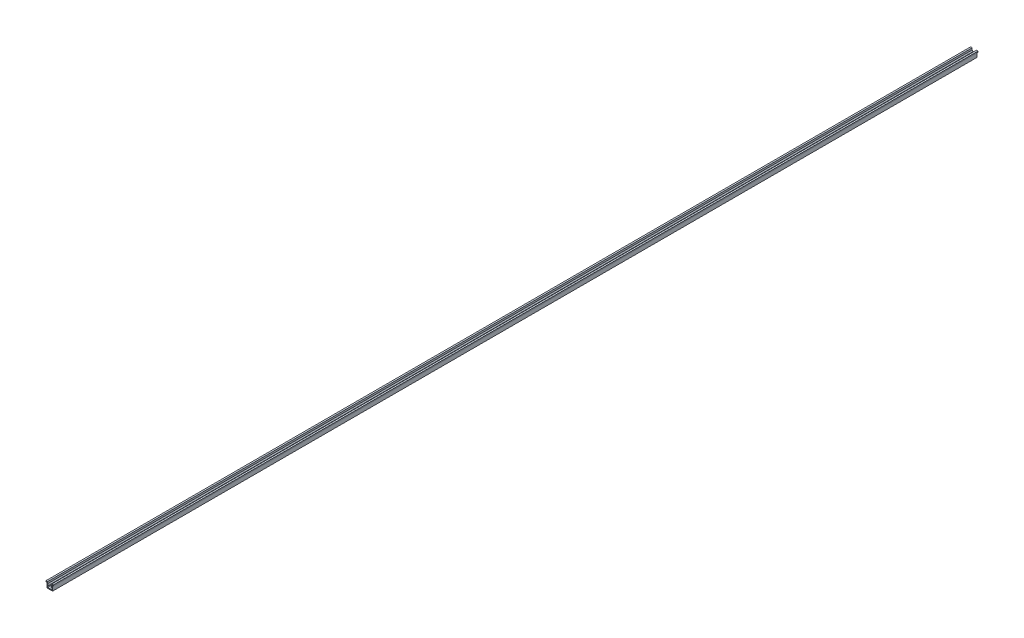
ISO-10303-21;
HEADER;
FILE_DESCRIPTION(('STEP AP214'),'2;1');
FILE_NAME('part.step','',(''),(''),'','','');
FILE_SCHEMA(('AUTOMOTIVE_DESIGN { 1 0 10303 214 1 1 1 1 }'));
ENDSEC;
DATA;
#1=APPLICATION_CONTEXT('core data for automotive mechanical design processes');
#2=APPLICATION_PROTOCOL_DEFINITION('international standard','automotive_design',2000,#1);
#3=PRODUCT_CONTEXT('',#1,'mechanical');
#4=PRODUCT('Part','Part','',(#3));
#5=PRODUCT_RELATED_PRODUCT_CATEGORY('part','',(#4));
#6=PRODUCT_DEFINITION_FORMATION('','',#4);
#7=PRODUCT_DEFINITION_CONTEXT('part definition',#1,'design');
#8=PRODUCT_DEFINITION('design','',#6,#7);
#9=PRODUCT_DEFINITION_SHAPE('','',#8);
#10=(LENGTH_UNIT() NAMED_UNIT(*) SI_UNIT(.MILLI.,.METRE.));
#11=(NAMED_UNIT(*) PLANE_ANGLE_UNIT() SI_UNIT($,.RADIAN.));
#12=(NAMED_UNIT(*) SI_UNIT($,.STERADIAN.) SOLID_ANGLE_UNIT());
#13=UNCERTAINTY_MEASURE_WITH_UNIT(LENGTH_MEASURE(1.E-05),#10,'distance_accuracy_value','');
#14=(GEOMETRIC_REPRESENTATION_CONTEXT(3) GLOBAL_UNCERTAINTY_ASSIGNED_CONTEXT((#13)) GLOBAL_UNIT_ASSIGNED_CONTEXT((#10,
#11,#12)) REPRESENTATION_CONTEXT('',''));
#15=CARTESIAN_POINT('',(0.,0.,0.));
#16=DIRECTION('',(0.,0.,1.));
#17=DIRECTION('',(1.,0.,0.));
#18=AXIS2_PLACEMENT_3D('',#15,#16,#17);
#19=CARTESIAN_POINT('',(-3.1,0.,1000.));
#20=DIRECTION('',(1.,0.,0.));
#21=DIRECTION('',(0.,0.,-1.));
#22=AXIS2_PLACEMENT_3D('',#19,#20,#21);
#23=PLANE('',#22);
#24=DIRECTION('',(0.,-1.,0.));
#25=VECTOR('',#24,1.);
#26=CARTESIAN_POINT('',(-3.1,0.,0.));
#27=LINE('',#26,#25);
#28=CARTESIAN_POINT('',(-3.1,5.3,0.));
#29=VERTEX_POINT('',#28);
#30=CARTESIAN_POINT('',(-3.1,0.,0.));
#31=VERTEX_POINT('',#30);
#32=EDGE_CURVE('E203',#29,#31,#27,.T.);
#33=ORIENTED_EDGE('',*,*,#32,.T.);
#34=DIRECTION('',(0.,0.,-1.));
#35=VECTOR('',#34,1.);
#36=CARTESIAN_POINT('',(-3.1,0.,1000.));
#37=LINE('',#36,#35);
#38=CARTESIAN_POINT('',(-3.1,0.,1000.));
#39=VERTEX_POINT('',#38);
#40=EDGE_CURVE('E11',#39,#31,#37,.T.);
#41=ORIENTED_EDGE('',*,*,#40,.F.);
#42=DIRECTION('',(0.,-1.,0.));
#43=VECTOR('',#42,1.);
#44=CARTESIAN_POINT('',(-3.1,0.,1000.));
#45=LINE('',#44,#43);
#46=CARTESIAN_POINT('',(-3.1,5.3,1000.));
#47=VERTEX_POINT('',#46);
#48=EDGE_CURVE('E241',#47,#39,#45,.T.);
#49=ORIENTED_EDGE('',*,*,#48,.F.);
#50=DIRECTION('',(0.,0.,-1.));
#51=VECTOR('',#50,1.);
#52=CARTESIAN_POINT('',(-3.1,5.3,1000.));
#53=LINE('',#52,#51);
#54=EDGE_CURVE('E199',#47,#29,#53,.T.);
#55=ORIENTED_EDGE('',*,*,#54,.T.);
#56=EDGE_LOOP('',(#33,#41,#49,#55));
#57=FACE_BOUND('',#56,.T.);
#58=ADVANCED_FACE('F35',(#57),#23,.F.);
#59=CARTESIAN_POINT('',(3.1,0.,1000.));
#60=DIRECTION('',(0.,1.,0.));
#61=DIRECTION('',(0.,0.,1.));
#62=AXIS2_PLACEMENT_3D('',#59,#60,#61);
#63=PLANE('',#62);
#64=DIRECTION('',(1.,0.,0.));
#65=VECTOR('',#64,1.);
#66=CARTESIAN_POINT('',(3.1,0.,0.));
#67=LINE('',#66,#65);
#68=CARTESIAN_POINT('',(3.1,0.,0.));
#69=VERTEX_POINT('',#68);
#70=EDGE_CURVE('E206',#31,#69,#67,.T.);
#71=ORIENTED_EDGE('',*,*,#70,.T.);
#72=DIRECTION('',(0.,0.,-1.));
#73=VECTOR('',#72,1.);
#74=CARTESIAN_POINT('',(3.1,0.,1000.));
#75=LINE('',#74,#73);
#76=CARTESIAN_POINT('',(3.1,0.,1000.));
#77=VERTEX_POINT('',#76);
#78=EDGE_CURVE('E43',#77,#69,#75,.T.);
#79=ORIENTED_EDGE('',*,*,#78,.F.);
#80=DIRECTION('',(1.,0.,0.));
#81=VECTOR('',#80,1.);
#82=CARTESIAN_POINT('',(3.1,0.,1000.));
#83=LINE('',#82,#81);
#84=EDGE_CURVE('E130',#39,#77,#83,.T.);
#85=ORIENTED_EDGE('',*,*,#84,.F.);
#86=ORIENTED_EDGE('',*,*,#40,.T.);
#87=EDGE_LOOP('',(#71,#79,#85,#86));
#88=FACE_BOUND('',#87,.T.);
#89=ADVANCED_FACE('F359',(#88),#63,.F.);
#90=CARTESIAN_POINT('',(3.1,0.,1000.));
#91=DIRECTION('',(-1.,0.,0.));
#92=DIRECTION('',(0.,-1.,0.));
#93=AXIS2_PLACEMENT_3D('',#90,#91,#92);
#94=PLANE('',#93);
#95=DIRECTION('',(0.,1.,0.));
#96=VECTOR('',#95,1.);
#97=CARTESIAN_POINT('',(3.1,0.,0.));
#98=LINE('',#97,#96);
#99=CARTESIAN_POINT('',(3.1,5.3,0.));
#100=VERTEX_POINT('',#99);
#101=EDGE_CURVE('E208',#69,#100,#98,.T.);
#102=ORIENTED_EDGE('',*,*,#101,.T.);
#103=DIRECTION('',(0.,0.,-1.));
#104=VECTOR('',#103,1.);
#105=CARTESIAN_POINT('',(3.1,5.3,1000.));
#106=LINE('',#105,#104);
#107=CARTESIAN_POINT('',(3.1,5.3,1000.));
#108=VERTEX_POINT('',#107);
#109=EDGE_CURVE('E284',#108,#100,#106,.T.);
#110=ORIENTED_EDGE('',*,*,#109,.F.);
#111=DIRECTION('',(0.,1.,0.));
#112=VECTOR('',#111,1.);
#113=CARTESIAN_POINT('',(3.1,0.,1000.));
#114=LINE('',#113,#112);
#115=EDGE_CURVE('E292',#77,#108,#114,.T.);
#116=ORIENTED_EDGE('',*,*,#115,.F.);
#117=ORIENTED_EDGE('',*,*,#78,.T.);
#118=EDGE_LOOP('',(#102,#110,#116,#117));
#119=FACE_BOUND('',#118,.T.);
#120=ADVANCED_FACE('F290',(#119),#94,.F.);
#121=CARTESIAN_POINT('',(3.1,5.3,1000.));
#122=DIRECTION('',(0.,1.,0.));
#123=DIRECTION('',(-1.,0.,0.));
#124=AXIS2_PLACEMENT_3D('',#121,#122,#123);
#125=PLANE('',#124);
#126=DIRECTION('',(1.,0.,0.));
#127=VECTOR('',#126,1.);
#128=CARTESIAN_POINT('',(3.1,5.3,0.));
#129=LINE('',#128,#127);
#130=CARTESIAN_POINT('',(4.,5.3,0.));
#131=VERTEX_POINT('',#130);
#132=EDGE_CURVE('E210',#100,#131,#129,.T.);
#133=ORIENTED_EDGE('',*,*,#132,.T.);
#134=DIRECTION('',(0.,0.,-1.));
#135=VECTOR('',#134,1.);
#136=CARTESIAN_POINT('',(4.,5.3,1000.));
#137=LINE('',#136,#135);
#138=CARTESIAN_POINT('',(4.,5.3,1000.));
#139=VERTEX_POINT('',#138);
#140=EDGE_CURVE('E281',#139,#131,#137,.T.);
#141=ORIENTED_EDGE('',*,*,#140,.F.);
#142=DIRECTION('',(1.,0.,0.));
#143=VECTOR('',#142,1.);
#144=CARTESIAN_POINT('',(3.1,5.3,1000.));
#145=LINE('',#144,#143);
#146=EDGE_CURVE('E310',#108,#139,#145,.T.);
#147=ORIENTED_EDGE('',*,*,#146,.F.);
#148=ORIENTED_EDGE('',*,*,#109,.T.);
#149=EDGE_LOOP('',(#133,#141,#147,#148));
#150=FACE_BOUND('',#149,.T.);
#151=ADVANCED_FACE('F301',(#150),#125,.F.);
#152=CARTESIAN_POINT('',(4.,5.3,1000.));
#153=DIRECTION('',(-1.,0.,0.));
#154=DIRECTION('',(0.,0.,1.));
#155=AXIS2_PLACEMENT_3D('',#152,#153,#154);
#156=PLANE('',#155);
#157=DIRECTION('',(0.,1.,0.));
#158=VECTOR('',#157,1.);
#159=CARTESIAN_POINT('',(4.,5.3,0.));
#160=LINE('',#159,#158);
#161=CARTESIAN_POINT('',(4.,6.3,0.));
#162=VERTEX_POINT('',#161);
#163=EDGE_CURVE('E212',#131,#162,#160,.T.);
#164=ORIENTED_EDGE('',*,*,#163,.T.);
#165=DIRECTION('',(0.,0.,-1.));
#166=VECTOR('',#165,1.);
#167=CARTESIAN_POINT('',(4.,6.3,1000.));
#168=LINE('',#167,#166);
#169=CARTESIAN_POINT('',(4.,6.3,1000.));
#170=VERTEX_POINT('',#169);
#171=EDGE_CURVE('E278',#170,#162,#168,.T.);
#172=ORIENTED_EDGE('',*,*,#171,.F.);
#173=DIRECTION('',(0.,1.,0.));
#174=VECTOR('',#173,1.);
#175=CARTESIAN_POINT('',(4.,5.3,1000.));
#176=LINE('',#175,#174);
#177=EDGE_CURVE('E307',#139,#170,#176,.T.);
#178=ORIENTED_EDGE('',*,*,#177,.F.);
#179=ORIENTED_EDGE('',*,*,#140,.T.);
#180=EDGE_LOOP('',(#164,#172,#178,#179));
#181=FACE_BOUND('',#180,.T.);
#182=ADVANCED_FACE('F305',(#181),#156,.F.);
#183=CARTESIAN_POINT('',(4.,6.3,1000.));
#184=DIRECTION('',(0.,-1.,0.));
#185=DIRECTION('',(0.,0.,-1.));
#186=AXIS2_PLACEMENT_3D('',#183,#184,#185);
#187=PLANE('',#186);
#188=DIRECTION('',(-1.,0.,0.));
#189=VECTOR('',#188,1.);
#190=CARTESIAN_POINT('',(4.,6.3,0.));
#191=LINE('',#190,#189);
#192=CARTESIAN_POINT('',(2.25,6.3,0.));
#193=VERTEX_POINT('',#192);
#194=EDGE_CURVE('E214',#162,#193,#191,.T.);
#195=ORIENTED_EDGE('',*,*,#194,.T.);
#196=DIRECTION('',(0.,0.,-1.));
#197=VECTOR('',#196,1.);
#198=CARTESIAN_POINT('',(2.25,6.3,1000.));
#199=LINE('',#198,#197);
#200=CARTESIAN_POINT('',(2.25,6.3,1000.));
#201=VERTEX_POINT('',#200);
#202=EDGE_CURVE('E275',#201,#193,#199,.T.);
#203=ORIENTED_EDGE('',*,*,#202,.F.);
#204=DIRECTION('',(-1.,0.,0.));
#205=VECTOR('',#204,1.);
#206=CARTESIAN_POINT('',(4.,6.3,1000.));
#207=LINE('',#206,#205);
#208=EDGE_CURVE('E309',#170,#201,#207,.T.);
#209=ORIENTED_EDGE('',*,*,#208,.F.);
#210=ORIENTED_EDGE('',*,*,#171,.T.);
#211=EDGE_LOOP('',(#195,#203,#209,#210));
#212=FACE_BOUND('',#211,.T.);
#213=ADVANCED_FACE('F372',(#212),#187,.F.);
#214=CARTESIAN_POINT('',(2.25,6.3,1000.));
#215=DIRECTION('',(1.,0.,0.));
#216=DIRECTION('',(0.,1.,0.));
#217=AXIS2_PLACEMENT_3D('',#214,#215,#216);
#218=PLANE('',#217);
#219=DIRECTION('',(0.,-1.,0.));
#220=VECTOR('',#219,1.);
#221=CARTESIAN_POINT('',(2.25,6.3,0.));
#222=LINE('',#221,#220);
#223=CARTESIAN_POINT('',(2.25,4.3,0.));
#224=VERTEX_POINT('',#223);
#225=EDGE_CURVE('E216',#193,#224,#222,.T.);
#226=ORIENTED_EDGE('',*,*,#225,.T.);
#227=DIRECTION('',(0.,0.,-1.));
#228=VECTOR('',#227,1.);
#229=CARTESIAN_POINT('',(2.25,4.3,1000.));
#230=LINE('',#229,#228);
#231=CARTESIAN_POINT('',(2.25,4.3,1000.));
#232=VERTEX_POINT('',#231);
#233=EDGE_CURVE('E272',#232,#224,#230,.T.);
#234=ORIENTED_EDGE('',*,*,#233,.F.);
#235=DIRECTION('',(0.,-1.,0.));
#236=VECTOR('',#235,1.);
#237=CARTESIAN_POINT('',(2.25,6.3,1000.));
#238=LINE('',#237,#236);
#239=EDGE_CURVE('E312',#201,#232,#238,.T.);
#240=ORIENTED_EDGE('',*,*,#239,.F.);
#241=ORIENTED_EDGE('',*,*,#202,.T.);
#242=EDGE_LOOP('',(#226,#234,#240,#241));
#243=FACE_BOUND('',#242,.T.);
#244=ADVANCED_FACE('F375',(#243),#218,.F.);
#245=CARTESIAN_POINT('',(2.25,4.3,1000.));
#246=DIRECTION('',(0.707106781186546,-0.707106781186549,0.));
#247=DIRECTION('',(0.707106781186549,0.707106781186546,0.));
#248=AXIS2_PLACEMENT_3D('',#245,#246,#247);
#249=PLANE('',#248);
#250=DIRECTION('',(-0.707106781186549,-0.707106781186546,0.));
#251=VECTOR('',#250,1.);
#252=CARTESIAN_POINT('',(2.25,4.3,0.));
#253=LINE('',#252,#251);
#254=CARTESIAN_POINT('',(1.18933982822018,3.23933982822018,0.));
#255=VERTEX_POINT('',#254);
#256=EDGE_CURVE('E218',#224,#255,#253,.T.);
#257=ORIENTED_EDGE('',*,*,#256,.T.);
#258=DIRECTION('',(0.,0.,-1.));
#259=VECTOR('',#258,1.);
#260=CARTESIAN_POINT('',(1.18933982822018,3.23933982822018,1000.));
#261=LINE('',#260,#259);
#262=CARTESIAN_POINT('',(1.18933982822018,3.23933982822018,1000.));
#263=VERTEX_POINT('',#262);
#264=EDGE_CURVE('E269',#263,#255,#261,.T.);
#265=ORIENTED_EDGE('',*,*,#264,.F.);
#266=DIRECTION('',(-0.707106781186549,-0.707106781186546,0.));
#267=VECTOR('',#266,1.);
#268=CARTESIAN_POINT('',(2.25,4.3,1000.));
#269=LINE('',#268,#267);
#270=EDGE_CURVE('E318',#232,#263,#269,.T.);
#271=ORIENTED_EDGE('',*,*,#270,.F.);
#272=ORIENTED_EDGE('',*,*,#233,.T.);
#273=EDGE_LOOP('',(#257,#265,#271,#272));
#274=FACE_BOUND('',#273,.T.);
#275=ADVANCED_FACE('F379',(#274),#249,.F.);
#276=CARTESIAN_POINT('',(1.18933982822018,3.23933982822018,1000.));
#277=DIRECTION('',(0.70710678118655,0.707106781186546,0.));
#278=DIRECTION('',(-0.707106781186546,0.70710678118655,0.));
#279=AXIS2_PLACEMENT_3D('',#276,#277,#278);
#280=PLANE('',#279);
#281=DIRECTION('',(0.707106781186546,-0.70710678118655,0.));
#282=VECTOR('',#281,1.);
#283=CARTESIAN_POINT('',(1.18933982822018,3.23933982822018,0.));
#284=LINE('',#283,#282);
#285=CARTESIAN_POINT('',(1.6136038969321,2.81507575950825,0.));
#286=VERTEX_POINT('',#285);
#287=EDGE_CURVE('E220',#255,#286,#284,.T.);
#288=ORIENTED_EDGE('',*,*,#287,.T.);
#289=DIRECTION('',(0.,0.,-1.));
#290=VECTOR('',#289,1.);
#291=CARTESIAN_POINT('',(1.6136038969321,2.81507575950825,1000.));
#292=LINE('',#291,#290);
#293=CARTESIAN_POINT('',(1.6136038969321,2.81507575950825,1000.));
#294=VERTEX_POINT('',#293);
#295=EDGE_CURVE('E266',#294,#286,#292,.T.);
#296=ORIENTED_EDGE('',*,*,#295,.F.);
#297=DIRECTION('',(0.707106781186546,-0.70710678118655,0.));
#298=VECTOR('',#297,1.);
#299=CARTESIAN_POINT('',(1.18933982822018,3.23933982822018,1000.));
#300=LINE('',#299,#298);
#301=EDGE_CURVE('E320',#263,#294,#300,.T.);
#302=ORIENTED_EDGE('',*,*,#301,.F.);
#303=ORIENTED_EDGE('',*,*,#264,.T.);
#304=EDGE_LOOP('',(#288,#296,#302,#303));
#305=FACE_BOUND('',#304,.T.);
#306=ADVANCED_FACE('F383',(#305),#280,.F.);
#307=CARTESIAN_POINT('',(1.6136038969321,2.81507575950825,1000.));
#308=DIRECTION('',(-0.707106781186546,0.707106781186549,0.));
#309=DIRECTION('',(-0.707106781186549,-0.707106781186546,0.));
#310=AXIS2_PLACEMENT_3D('',#307,#308,#309);
#311=PLANE('',#310);
#312=DIRECTION('',(0.707106781186549,0.707106781186546,0.));
#313=VECTOR('',#312,1.);
#314=CARTESIAN_POINT('',(1.6136038969321,2.81507575950825,0.));
#315=LINE('',#314,#313);
#316=CARTESIAN_POINT('',(2.25,3.45147186257614,0.));
#317=VERTEX_POINT('',#316);
#318=EDGE_CURVE('E222',#286,#317,#315,.T.);
#319=ORIENTED_EDGE('',*,*,#318,.T.);
#320=DIRECTION('',(0.,0.,-1.));
#321=VECTOR('',#320,1.);
#322=CARTESIAN_POINT('',(2.25,3.45147186257614,1000.));
#323=LINE('',#322,#321);
#324=CARTESIAN_POINT('',(2.25,3.45147186257614,1000.));
#325=VERTEX_POINT('',#324);
#326=EDGE_CURVE('E263',#325,#317,#323,.T.);
#327=ORIENTED_EDGE('',*,*,#326,.F.);
#328=DIRECTION('',(0.707106781186549,0.707106781186546,0.));
#329=VECTOR('',#328,1.);
#330=CARTESIAN_POINT('',(1.6136038969321,2.81507575950825,1000.));
#331=LINE('',#330,#329);
#332=EDGE_CURVE('E322',#294,#325,#331,.T.);
#333=ORIENTED_EDGE('',*,*,#332,.F.);
#334=ORIENTED_EDGE('',*,*,#295,.T.);
#335=EDGE_LOOP('',(#319,#327,#333,#334));
#336=FACE_BOUND('',#335,.T.);
#337=ADVANCED_FACE('F387',(#336),#311,.F.);
#338=CARTESIAN_POINT('',(2.25,3.45147186257614,1000.));
#339=DIRECTION('',(1.,0.,0.));
#340=DIRECTION('',(0.,1.,0.));
#341=AXIS2_PLACEMENT_3D('',#338,#339,#340);
#342=PLANE('',#341);
#343=DIRECTION('',(0.,-1.,0.));
#344=VECTOR('',#343,1.);
#345=CARTESIAN_POINT('',(2.25,3.45147186257614,0.));
#346=LINE('',#345,#344);
#347=CARTESIAN_POINT('',(2.25,0.85,0.));
#348=VERTEX_POINT('',#347);
#349=EDGE_CURVE('E224',#317,#348,#346,.T.);
#350=ORIENTED_EDGE('',*,*,#349,.T.);
#351=DIRECTION('',(0.,0.,-1.));
#352=VECTOR('',#351,1.);
#353=CARTESIAN_POINT('',(2.25,0.85,1000.));
#354=LINE('',#353,#352);
#355=CARTESIAN_POINT('',(2.25,0.85,1000.));
#356=VERTEX_POINT('',#355);
#357=EDGE_CURVE('E260',#356,#348,#354,.T.);
#358=ORIENTED_EDGE('',*,*,#357,.F.);
#359=DIRECTION('',(0.,-1.,0.));
#360=VECTOR('',#359,1.);
#361=CARTESIAN_POINT('',(2.25,3.45147186257614,1000.));
#362=LINE('',#361,#360);
#363=EDGE_CURVE('E324',#325,#356,#362,.T.);
#364=ORIENTED_EDGE('',*,*,#363,.F.);
#365=ORIENTED_EDGE('',*,*,#326,.T.);
#366=EDGE_LOOP('',(#350,#358,#364,#365));
#367=FACE_BOUND('',#366,.T.);
#368=ADVANCED_FACE('F391',(#367),#342,.F.);
#369=CARTESIAN_POINT('',(-2.25,0.85,1000.));
#370=DIRECTION('',(0.,-1.,0.));
#371=DIRECTION('',(1.,0.,0.));
#372=AXIS2_PLACEMENT_3D('',#369,#370,#371);
#373=PLANE('',#372);
#374=DIRECTION('',(-1.,0.,0.));
#375=VECTOR('',#374,1.);
#376=CARTESIAN_POINT('',(-2.25,0.85,0.));
#377=LINE('',#376,#375);
#378=CARTESIAN_POINT('',(-2.25,0.85,0.));
#379=VERTEX_POINT('',#378);
#380=EDGE_CURVE('E226',#348,#379,#377,.T.);
#381=ORIENTED_EDGE('',*,*,#380,.T.);
#382=DIRECTION('',(0.,0.,-1.));
#383=VECTOR('',#382,1.);
#384=CARTESIAN_POINT('',(-2.25,0.85,1000.));
#385=LINE('',#384,#383);
#386=CARTESIAN_POINT('',(-2.25,0.85,1000.));
#387=VERTEX_POINT('',#386);
#388=EDGE_CURVE('E257',#387,#379,#385,.T.);
#389=ORIENTED_EDGE('',*,*,#388,.F.);
#390=DIRECTION('',(-1.,0.,0.));
#391=VECTOR('',#390,1.);
#392=CARTESIAN_POINT('',(-2.25,0.85,1000.));
#393=LINE('',#392,#391);
#394=EDGE_CURVE('E326',#356,#387,#393,.T.);
#395=ORIENTED_EDGE('',*,*,#394,.F.);
#396=ORIENTED_EDGE('',*,*,#357,.T.);
#397=EDGE_LOOP('',(#381,#389,#395,#396));
#398=FACE_BOUND('',#397,.T.);
#399=ADVANCED_FACE('F395',(#398),#373,.F.);
#400=CARTESIAN_POINT('',(-2.25,3.45147186257614,1000.));
#401=DIRECTION('',(-1.,0.,0.));
#402=DIRECTION('',(0.,0.,1.));
#403=AXIS2_PLACEMENT_3D('',#400,#401,#402);
#404=PLANE('',#403);
#405=DIRECTION('',(0.,1.,0.));
#406=VECTOR('',#405,1.);
#407=CARTESIAN_POINT('',(-2.25,3.45147186257614,0.));
#408=LINE('',#407,#406);
#409=CARTESIAN_POINT('',(-2.25,3.45147186257614,0.));
#410=VERTEX_POINT('',#409);
#411=EDGE_CURVE('E228',#379,#410,#408,.T.);
#412=ORIENTED_EDGE('',*,*,#411,.T.);
#413=DIRECTION('',(0.,0.,-1.));
#414=VECTOR('',#413,1.);
#415=CARTESIAN_POINT('',(-2.25,3.45147186257614,1000.));
#416=LINE('',#415,#414);
#417=CARTESIAN_POINT('',(-2.25,3.45147186257614,1000.));
#418=VERTEX_POINT('',#417);
#419=EDGE_CURVE('E254',#418,#410,#416,.T.);
#420=ORIENTED_EDGE('',*,*,#419,.F.);
#421=DIRECTION('',(0.,1.,0.));
#422=VECTOR('',#421,1.);
#423=CARTESIAN_POINT('',(-2.25,3.45147186257614,1000.));
#424=LINE('',#423,#422);
#425=EDGE_CURVE('E328',#387,#418,#424,.T.);
#426=ORIENTED_EDGE('',*,*,#425,.F.);
#427=ORIENTED_EDGE('',*,*,#388,.T.);
#428=EDGE_LOOP('',(#412,#420,#426,#427));
#429=FACE_BOUND('',#428,.T.);
#430=ADVANCED_FACE('F399',(#429),#404,.F.);
#431=CARTESIAN_POINT('',(-1.6136038969321,2.81507575950825,1000.));
#432=DIRECTION('',(0.707106781186546,0.707106781186549,0.));
#433=DIRECTION('',(-0.707106781186549,0.707106781186546,0.));
#434=AXIS2_PLACEMENT_3D('',#431,#432,#433);
#435=PLANE('',#434);
#436=DIRECTION('',(0.707106781186549,-0.707106781186546,0.));
#437=VECTOR('',#436,1.);
#438=CARTESIAN_POINT('',(-1.6136038969321,2.81507575950825,0.));
#439=LINE('',#438,#437);
#440=CARTESIAN_POINT('',(-1.6136038969321,2.81507575950825,0.));
#441=VERTEX_POINT('',#440);
#442=EDGE_CURVE('E230',#410,#441,#439,.T.);
#443=ORIENTED_EDGE('',*,*,#442,.T.);
#444=DIRECTION('',(0.,0.,-1.));
#445=VECTOR('',#444,1.);
#446=CARTESIAN_POINT('',(-1.6136038969321,2.81507575950825,1000.));
#447=LINE('',#446,#445);
#448=CARTESIAN_POINT('',(-1.6136038969321,2.81507575950825,1000.));
#449=VERTEX_POINT('',#448);
#450=EDGE_CURVE('E251',#449,#441,#447,.T.);
#451=ORIENTED_EDGE('',*,*,#450,.F.);
#452=DIRECTION('',(0.707106781186549,-0.707106781186546,0.));
#453=VECTOR('',#452,1.);
#454=CARTESIAN_POINT('',(-1.6136038969321,2.81507575950825,1000.));
#455=LINE('',#454,#453);
#456=EDGE_CURVE('E330',#418,#449,#455,.T.);
#457=ORIENTED_EDGE('',*,*,#456,.F.);
#458=ORIENTED_EDGE('',*,*,#419,.T.);
#459=EDGE_LOOP('',(#443,#451,#457,#458));
#460=FACE_BOUND('',#459,.T.);
#461=ADVANCED_FACE('F403',(#460),#435,.F.);
#462=CARTESIAN_POINT('',(-1.18933982822018,3.23933982822018,1000.));
#463=DIRECTION('',(-0.70710678118655,0.707106781186545,0.));
#464=DIRECTION('',(-0.707106781186545,-0.70710678118655,0.));
#465=AXIS2_PLACEMENT_3D('',#462,#463,#464);
#466=PLANE('',#465);
#467=DIRECTION('',(0.707106781186545,0.70710678118655,0.));
#468=VECTOR('',#467,1.);
#469=CARTESIAN_POINT('',(-1.18933982822018,3.23933982822018,0.));
#470=LINE('',#469,#468);
#471=CARTESIAN_POINT('',(-1.18933982822018,3.23933982822018,0.));
#472=VERTEX_POINT('',#471);
#473=EDGE_CURVE('E232',#441,#472,#470,.T.);
#474=ORIENTED_EDGE('',*,*,#473,.T.);
#475=DIRECTION('',(0.,0.,-1.));
#476=VECTOR('',#475,1.);
#477=CARTESIAN_POINT('',(-1.18933982822018,3.23933982822018,1000.));
#478=LINE('',#477,#476);
#479=CARTESIAN_POINT('',(-1.18933982822018,3.23933982822018,1000.));
#480=VERTEX_POINT('',#479);
#481=EDGE_CURVE('E248',#480,#472,#478,.T.);
#482=ORIENTED_EDGE('',*,*,#481,.F.);
#483=DIRECTION('',(0.707106781186545,0.70710678118655,0.));
#484=VECTOR('',#483,1.);
#485=CARTESIAN_POINT('',(-1.18933982822018,3.23933982822018,1000.));
#486=LINE('',#485,#484);
#487=EDGE_CURVE('E332',#449,#480,#486,.T.);
#488=ORIENTED_EDGE('',*,*,#487,.F.);
#489=ORIENTED_EDGE('',*,*,#450,.T.);
#490=EDGE_LOOP('',(#474,#482,#488,#489));
#491=FACE_BOUND('',#490,.T.);
#492=ADVANCED_FACE('F407',(#491),#466,.F.);
#493=CARTESIAN_POINT('',(-2.25,4.3,1000.));
#494=DIRECTION('',(-0.707106781186546,-0.707106781186549,0.));
#495=DIRECTION('',(0.707106781186549,-0.707106781186546,0.));
#496=AXIS2_PLACEMENT_3D('',#493,#494,#495);
#497=PLANE('',#496);
#498=DIRECTION('',(-0.707106781186549,0.707106781186546,0.));
#499=VECTOR('',#498,1.);
#500=CARTESIAN_POINT('',(-2.25,4.3,0.));
#501=LINE('',#500,#499);
#502=CARTESIAN_POINT('',(-2.25,4.3,0.));
#503=VERTEX_POINT('',#502);
#504=EDGE_CURVE('E234',#472,#503,#501,.T.);
#505=ORIENTED_EDGE('',*,*,#504,.T.);
#506=DIRECTION('',(0.,0.,-1.));
#507=VECTOR('',#506,1.);
#508=CARTESIAN_POINT('',(-2.25,4.3,1000.));
#509=LINE('',#508,#507);
#510=CARTESIAN_POINT('',(-2.25,4.3,1000.));
#511=VERTEX_POINT('',#510);
#512=EDGE_CURVE('E245',#511,#503,#509,.T.);
#513=ORIENTED_EDGE('',*,*,#512,.F.);
#514=DIRECTION('',(-0.707106781186549,0.707106781186546,0.));
#515=VECTOR('',#514,1.);
#516=CARTESIAN_POINT('',(-2.25,4.3,1000.));
#517=LINE('',#516,#515);
#518=EDGE_CURVE('E334',#480,#511,#517,.T.);
#519=ORIENTED_EDGE('',*,*,#518,.F.);
#520=ORIENTED_EDGE('',*,*,#481,.T.);
#521=EDGE_LOOP('',(#505,#513,#519,#520));
#522=FACE_BOUND('',#521,.T.);
#523=ADVANCED_FACE('F340',(#522),#497,.F.);
#524=CARTESIAN_POINT('',(-2.25,6.3,1000.));
#525=DIRECTION('',(-1.,0.,0.));
#526=DIRECTION('',(0.,-1.,0.));
#527=AXIS2_PLACEMENT_3D('',#524,#525,#526);
#528=PLANE('',#527);
#529=DIRECTION('',(0.,1.,0.));
#530=VECTOR('',#529,1.);
#531=CARTESIAN_POINT('',(-2.25,6.3,0.));
#532=LINE('',#531,#530);
#533=CARTESIAN_POINT('',(-2.25,6.3,0.));
#534=VERTEX_POINT('',#533);
#535=EDGE_CURVE('E236',#503,#534,#532,.T.);
#536=ORIENTED_EDGE('',*,*,#535,.T.);
#537=DIRECTION('',(0.,0.,-1.));
#538=VECTOR('',#537,1.);
#539=CARTESIAN_POINT('',(-2.25,6.3,1000.));
#540=LINE('',#539,#538);
#541=CARTESIAN_POINT('',(-2.25,6.3,1000.));
#542=VERTEX_POINT('',#541);
#543=EDGE_CURVE('E194',#542,#534,#540,.T.);
#544=ORIENTED_EDGE('',*,*,#543,.F.);
#545=DIRECTION('',(0.,1.,0.));
#546=VECTOR('',#545,1.);
#547=CARTESIAN_POINT('',(-2.25,6.3,1000.));
#548=LINE('',#547,#546);
#549=EDGE_CURVE('E185',#511,#542,#548,.T.);
#550=ORIENTED_EDGE('',*,*,#549,.F.);
#551=ORIENTED_EDGE('',*,*,#512,.T.);
#552=EDGE_LOOP('',(#536,#544,#550,#551));
#553=FACE_BOUND('',#552,.T.);
#554=ADVANCED_FACE('F344',(#553),#528,.F.);
#555=CARTESIAN_POINT('',(-4.,6.3,1000.));
#556=DIRECTION('',(0.,-1.,0.));
#557=DIRECTION('',(0.,0.,-1.));
#558=AXIS2_PLACEMENT_3D('',#555,#556,#557);
#559=PLANE('',#558);
#560=DIRECTION('',(-1.,0.,0.));
#561=VECTOR('',#560,1.);
#562=CARTESIAN_POINT('',(-4.,6.3,0.));
#563=LINE('',#562,#561);
#564=CARTESIAN_POINT('',(-4.,6.3,0.));
#565=VERTEX_POINT('',#564);
#566=EDGE_CURVE('E193',#534,#565,#563,.T.);
#567=ORIENTED_EDGE('',*,*,#566,.T.);
#568=DIRECTION('',(0.,0.,-1.));
#569=VECTOR('',#568,1.);
#570=CARTESIAN_POINT('',(-4.,6.3,1000.));
#571=LINE('',#570,#569);
#572=CARTESIAN_POINT('',(-4.,6.3,1000.));
#573=VERTEX_POINT('',#572);
#574=EDGE_CURVE('E190',#573,#565,#571,.T.);
#575=ORIENTED_EDGE('',*,*,#574,.F.);
#576=DIRECTION('',(-1.,0.,0.));
#577=VECTOR('',#576,1.);
#578=CARTESIAN_POINT('',(-4.,6.3,1000.));
#579=LINE('',#578,#577);
#580=EDGE_CURVE('E179',#542,#573,#579,.T.);
#581=ORIENTED_EDGE('',*,*,#580,.F.);
#582=ORIENTED_EDGE('',*,*,#543,.T.);
#583=EDGE_LOOP('',(#567,#575,#581,#582));
#584=FACE_BOUND('',#583,.T.);
#585=ADVANCED_FACE('F191',(#584),#559,.F.);
#586=CARTESIAN_POINT('',(-4.,5.3,1000.));
#587=DIRECTION('',(1.,0.,0.));
#588=DIRECTION('',(0.,0.,-1.));
#589=AXIS2_PLACEMENT_3D('',#586,#587,#588);
#590=PLANE('',#589);
#591=DIRECTION('',(0.,-1.,0.));
#592=VECTOR('',#591,1.);
#593=CARTESIAN_POINT('',(-4.,5.3,0.));
#594=LINE('',#593,#592);
#595=CARTESIAN_POINT('',(-4.,5.3,0.));
#596=VERTEX_POINT('',#595);
#597=EDGE_CURVE('E116',#565,#596,#594,.T.);
#598=ORIENTED_EDGE('',*,*,#597,.T.);
#599=DIRECTION('',(0.,0.,-1.));
#600=VECTOR('',#599,1.);
#601=CARTESIAN_POINT('',(-4.,5.3,1000.));
#602=LINE('',#601,#600);
#603=CARTESIAN_POINT('',(-4.,5.3,1000.));
#604=VERTEX_POINT('',#603);
#605=EDGE_CURVE('E195',#604,#596,#602,.T.);
#606=ORIENTED_EDGE('',*,*,#605,.F.);
#607=DIRECTION('',(0.,-1.,0.));
#608=VECTOR('',#607,1.);
#609=CARTESIAN_POINT('',(-4.,5.3,1000.));
#610=LINE('',#609,#608);
#611=EDGE_CURVE('E183',#573,#604,#610,.T.);
#612=ORIENTED_EDGE('',*,*,#611,.F.);
#613=ORIENTED_EDGE('',*,*,#574,.T.);
#614=EDGE_LOOP('',(#598,#606,#612,#613));
#615=FACE_BOUND('',#614,.T.);
#616=ADVANCED_FACE('F197',(#615),#590,.F.);
#617=CARTESIAN_POINT('',(-3.1,5.3,1000.));
#618=DIRECTION('',(0.,1.,0.));
#619=DIRECTION('',(-1.,0.,0.));
#620=AXIS2_PLACEMENT_3D('',#617,#618,#619);
#621=PLANE('',#620);
#622=DIRECTION('',(1.,0.,0.));
#623=VECTOR('',#622,1.);
#624=CARTESIAN_POINT('',(-3.1,5.3,0.));
#625=LINE('',#624,#623);
#626=EDGE_CURVE('E122',#596,#29,#625,.T.);
#627=ORIENTED_EDGE('',*,*,#626,.T.);
#628=ORIENTED_EDGE('',*,*,#54,.F.);
#629=DIRECTION('',(1.,0.,0.));
#630=VECTOR('',#629,1.);
#631=CARTESIAN_POINT('',(-3.1,5.3,1000.));
#632=LINE('',#631,#630);
#633=EDGE_CURVE('E51',#604,#47,#632,.T.);
#634=ORIENTED_EDGE('',*,*,#633,.F.);
#635=ORIENTED_EDGE('',*,*,#605,.T.);
#636=EDGE_LOOP('',(#627,#628,#634,#635));
#637=FACE_BOUND('',#636,.T.);
#638=ADVANCED_FACE('F348',(#637),#621,.F.);
#639=CARTESIAN_POINT('',(0.,0.,1000.));
#640=DIRECTION('',(0.,0.,1.));
#641=DIRECTION('',(1.,0.,0.));
#642=AXIS2_PLACEMENT_3D('',#639,#640,#641);
#643=PLANE('',#642);
#644=ORIENTED_EDGE('',*,*,#48,.T.);
#645=ORIENTED_EDGE('',*,*,#84,.T.);
#646=ORIENTED_EDGE('',*,*,#115,.T.);
#647=ORIENTED_EDGE('',*,*,#146,.T.);
#648=ORIENTED_EDGE('',*,*,#177,.T.);
#649=ORIENTED_EDGE('',*,*,#208,.T.);
#650=ORIENTED_EDGE('',*,*,#239,.T.);
#651=ORIENTED_EDGE('',*,*,#270,.T.);
#652=ORIENTED_EDGE('',*,*,#301,.T.);
#653=ORIENTED_EDGE('',*,*,#332,.T.);
#654=ORIENTED_EDGE('',*,*,#363,.T.);
#655=ORIENTED_EDGE('',*,*,#394,.T.);
#656=ORIENTED_EDGE('',*,*,#425,.T.);
#657=ORIENTED_EDGE('',*,*,#456,.T.);
#658=ORIENTED_EDGE('',*,*,#487,.T.);
#659=ORIENTED_EDGE('',*,*,#518,.T.);
#660=ORIENTED_EDGE('',*,*,#549,.T.);
#661=ORIENTED_EDGE('',*,*,#580,.T.);
#662=ORIENTED_EDGE('',*,*,#611,.T.);
#663=ORIENTED_EDGE('',*,*,#633,.T.);
#664=EDGE_LOOP('',(#644,#645,#646,#647,#648,#649,#650,#651,#652,#653,#654,#655,#656,#657,#658,
#659,#660,#661,#662,#663));
#665=FACE_BOUND('',#664,.T.);
#666=ADVANCED_FACE('F181',(#665),#643,.T.);
#667=CARTESIAN_POINT('',(0.,0.,0.));
#668=DIRECTION('',(0.,0.,1.));
#669=DIRECTION('',(1.,0.,0.));
#670=AXIS2_PLACEMENT_3D('',#667,#668,#669);
#671=PLANE('',#670);
#672=ORIENTED_EDGE('',*,*,#32,.F.);
#673=ORIENTED_EDGE('',*,*,#626,.F.);
#674=ORIENTED_EDGE('',*,*,#597,.F.);
#675=ORIENTED_EDGE('',*,*,#566,.F.);
#676=ORIENTED_EDGE('',*,*,#535,.F.);
#677=ORIENTED_EDGE('',*,*,#504,.F.);
#678=ORIENTED_EDGE('',*,*,#473,.F.);
#679=ORIENTED_EDGE('',*,*,#442,.F.);
#680=ORIENTED_EDGE('',*,*,#411,.F.);
#681=ORIENTED_EDGE('',*,*,#380,.F.);
#682=ORIENTED_EDGE('',*,*,#349,.F.);
#683=ORIENTED_EDGE('',*,*,#318,.F.);
#684=ORIENTED_EDGE('',*,*,#287,.F.);
#685=ORIENTED_EDGE('',*,*,#256,.F.);
#686=ORIENTED_EDGE('',*,*,#225,.F.);
#687=ORIENTED_EDGE('',*,*,#194,.F.);
#688=ORIENTED_EDGE('',*,*,#163,.F.);
#689=ORIENTED_EDGE('',*,*,#132,.F.);
#690=ORIENTED_EDGE('',*,*,#101,.F.);
#691=ORIENTED_EDGE('',*,*,#70,.F.);
#692=EDGE_LOOP('',(#672,#673,#674,#675,#676,#677,#678,#679,#680,#681,#682,#683,#684,#685,#686,
#687,#688,#689,#690,#691));
#693=FACE_BOUND('',#692,.T.);
#694=ADVANCED_FACE('F296',(#693),#671,.F.);
#695=CLOSED_SHELL('',(#58,#89,#120,#151,#182,#213,#244,#275,#306,#337,#368,#399,#430,#461,#492,
#523,#554,#585,#616,#638,#666,#694));
#696=MANIFOLD_SOLID_BREP('B2',#695);
#697=ADVANCED_BREP_SHAPE_REPRESENTATION('',(#18,#696),#14);
#698=SHAPE_DEFINITION_REPRESENTATION(#9,#697);
ENDSEC;
END-ISO-10303-21;
